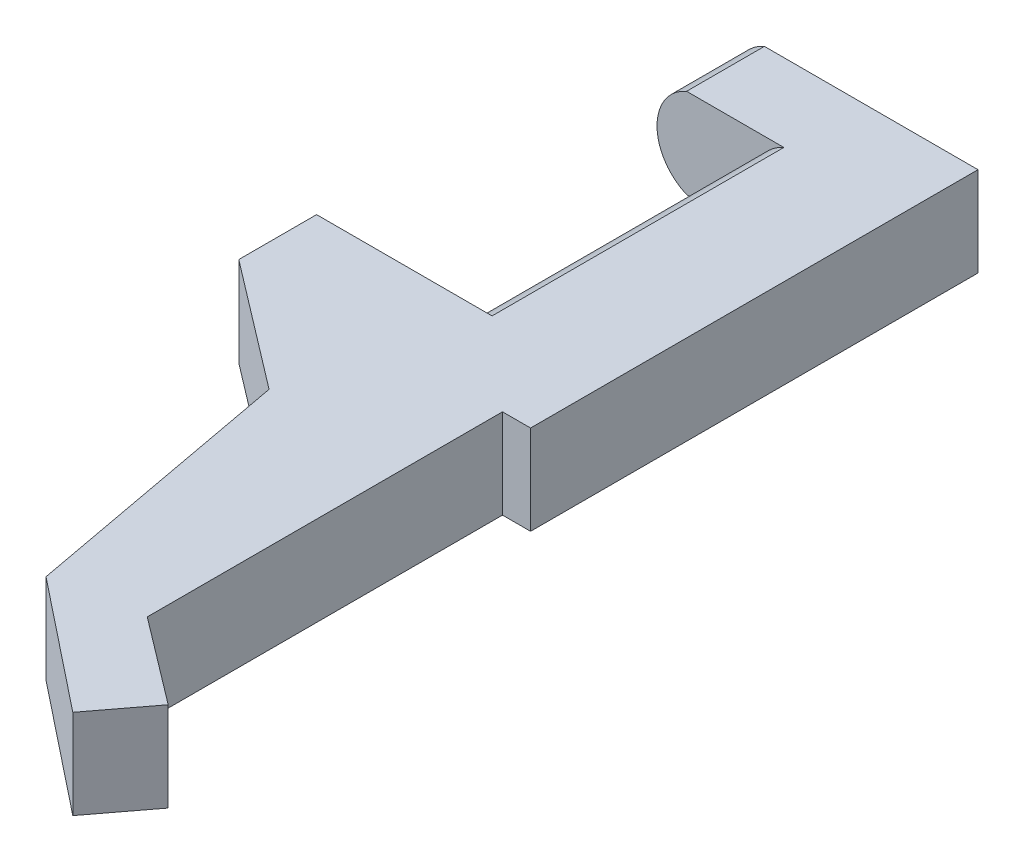
ISO-10303-21;
HEADER;
FILE_DESCRIPTION(('STEP AP214'),'2;1');
FILE_NAME('part.step','',(''),(''),'','','');
FILE_SCHEMA(('AUTOMOTIVE_DESIGN { 1 0 10303 214 1 1 1 1 }'));
ENDSEC;
DATA;
#1=APPLICATION_CONTEXT('core data for automotive mechanical design processes');
#2=APPLICATION_PROTOCOL_DEFINITION('international standard','automotive_design',2000,#1);
#3=PRODUCT_CONTEXT('',#1,'mechanical');
#4=PRODUCT('Part','Part','',(#3));
#5=PRODUCT_RELATED_PRODUCT_CATEGORY('part','',(#4));
#6=PRODUCT_DEFINITION_FORMATION('','',#4);
#7=PRODUCT_DEFINITION_CONTEXT('part definition',#1,'design');
#8=PRODUCT_DEFINITION('design','',#6,#7);
#9=PRODUCT_DEFINITION_SHAPE('','',#8);
#10=(LENGTH_UNIT() NAMED_UNIT(*) SI_UNIT(.MILLI.,.METRE.));
#11=(NAMED_UNIT(*) PLANE_ANGLE_UNIT() SI_UNIT($,.RADIAN.));
#12=(NAMED_UNIT(*) SI_UNIT($,.STERADIAN.) SOLID_ANGLE_UNIT());
#13=UNCERTAINTY_MEASURE_WITH_UNIT(LENGTH_MEASURE(1.E-05),#10,'distance_accuracy_value','');
#14=(GEOMETRIC_REPRESENTATION_CONTEXT(3) GLOBAL_UNCERTAINTY_ASSIGNED_CONTEXT((#13)) GLOBAL_UNIT_ASSIGNED_CONTEXT((#10,
#11,#12)) REPRESENTATION_CONTEXT('',''));
#15=CARTESIAN_POINT('',(0.,0.,0.));
#16=DIRECTION('',(0.,0.,1.));
#17=DIRECTION('',(1.,0.,0.));
#18=AXIS2_PLACEMENT_3D('',#15,#16,#17);
#19=CARTESIAN_POINT('',(0.,0.,4.));
#20=DIRECTION('',(0.,0.,-1.));
#21=DIRECTION('',(-1.,0.,0.));
#22=AXIS2_PLACEMENT_3D('',#19,#20,#21);
#23=PLANE('',#22);
#24=DIRECTION('',(0.,1.,0.));
#25=VECTOR('',#24,1.);
#26=CARTESIAN_POINT('',(539.301234579367,412.744075085687,4.));
#27=LINE('',#26,#25);
#28=CARTESIAN_POINT('',(539.301234579367,407.944075085687,4.));
#29=VERTEX_POINT('',#28);
#30=CARTESIAN_POINT('',(539.301234579367,412.544075085687,4.));
#31=VERTEX_POINT('',#30);
#32=EDGE_CURVE('E206',#29,#31,#27,.T.);
#33=ORIENTED_EDGE('',*,*,#32,.T.);
#34=DIRECTION('',(-1.,0.,0.));
#35=VECTOR('',#34,1.);
#36=CARTESIAN_POINT('',(0.,412.544075085687,4.));
#37=LINE('',#36,#35);
#38=CARTESIAN_POINT('',(537.858436246438,412.544075085687,4.));
#39=VERTEX_POINT('',#38);
#40=EDGE_CURVE('E249',#31,#39,#37,.T.);
#41=ORIENTED_EDGE('',*,*,#40,.T.);
#42=DIRECTION('',(0.,1.,0.));
#43=VECTOR('',#42,1.);
#44=CARTESIAN_POINT('',(537.858436246438,407.744075085687,4.));
#45=LINE('',#44,#43);
#46=CARTESIAN_POINT('',(537.858436246438,407.944075085687,4.));
#47=VERTEX_POINT('',#46);
#48=EDGE_CURVE('E203',#47,#39,#45,.T.);
#49=ORIENTED_EDGE('',*,*,#48,.F.);
#50=DIRECTION('',(1.,0.,0.));
#51=VECTOR('',#50,1.);
#52=CARTESIAN_POINT('',(0.,407.944075085687,4.));
#53=LINE('',#52,#51);
#54=EDGE_CURVE('E222',#47,#29,#53,.T.);
#55=ORIENTED_EDGE('',*,*,#54,.T.);
#56=EDGE_LOOP('',(#33,#41,#49,#55));
#57=FACE_BOUND('',#56,.T.);
#58=ADVANCED_FACE('F39',(#57),#23,.F.);
#59=CARTESIAN_POINT('',(534.301234579367,410.244075085687,-24.0138781886599));
#60=DIRECTION('',(0.,0.,1.));
#61=DIRECTION('',(1.,0.,0.));
#62=AXIS2_PLACEMENT_3D('',#59,#60,#61);
#63=CYLINDRICAL_SURFACE('',#62,2.5);
#64=DIRECTION('',(0.,0.,1.));
#65=VECTOR('',#64,1.);
#66=CARTESIAN_POINT('',(533.321438682254,412.544075085687,-24.0138781886599));
#67=LINE('',#66,#65);
#68=CARTESIAN_POINT('',(533.321438682254,412.544075085687,-15.));
#69=VERTEX_POINT('',#68);
#70=CARTESIAN_POINT('',(533.321438682254,412.544075085687,0.));
#71=VERTEX_POINT('',#70);
#72=EDGE_CURVE('E256',#69,#71,#67,.T.);
#73=ORIENTED_EDGE('',*,*,#72,.F.);
#74=CARTESIAN_POINT('',(534.301234579367,410.244075085687,-15.));
#75=DIRECTION('',(0.,0.,1.));
#76=DIRECTION('',(1.,0.,0.));
#77=AXIS2_PLACEMENT_3D('',#74,#75,#76);
#78=CIRCLE('',#77,2.5);
#79=CARTESIAN_POINT('',(533.321438682254,407.944075085687,-15.));
#80=VERTEX_POINT('',#79);
#81=EDGE_CURVE('E173',#80,#69,#78,.F.);
#82=ORIENTED_EDGE('',*,*,#81,.F.);
#83=DIRECTION('',(0.,0.,1.));
#84=VECTOR('',#83,1.);
#85=CARTESIAN_POINT('',(533.321438682254,407.944075085687,-24.0138781886599));
#86=LINE('',#85,#84);
#87=CARTESIAN_POINT('',(533.321438682254,407.944075085687,0.));
#88=VERTEX_POINT('',#87);
#89=EDGE_CURVE('E234',#88,#80,#86,.F.);
#90=ORIENTED_EDGE('',*,*,#89,.F.);
#91=CARTESIAN_POINT('',(534.301234579367,410.244075085687,0.));
#92=DIRECTION('',(0.,0.,1.));
#93=DIRECTION('',(1.,0.,0.));
#94=AXIS2_PLACEMENT_3D('',#91,#92,#93);
#95=CIRCLE('',#94,2.5);
#96=EDGE_CURVE('E165',#71,#88,#95,.T.);
#97=ORIENTED_EDGE('',*,*,#96,.F.);
#98=EDGE_LOOP('',(#73,#82,#90,#97));
#99=FACE_BOUND('',#98,.T.);
#100=ADVANCED_FACE('F41',(#99),#63,.T.);
#101=CARTESIAN_POINT('',(539.301234579367,412.744075085687,-24.0138781886599));
#102=DIRECTION('',(1.,0.,0.));
#103=DIRECTION('',(0.,0.,-1.));
#104=AXIS2_PLACEMENT_3D('',#101,#102,#103);
#105=PLANE('',#104);
#106=DIRECTION('',(0.,0.,-1.));
#107=VECTOR('',#106,1.);
#108=CARTESIAN_POINT('',(539.301234579367,412.544075085687,-24.0138781886599));
#109=LINE('',#108,#107);
#110=CARTESIAN_POINT('',(539.301234579367,412.544075085687,-19.));
#111=VERTEX_POINT('',#110);
#112=EDGE_CURVE('E254',#31,#111,#109,.T.);
#113=ORIENTED_EDGE('',*,*,#112,.F.);
#114=ORIENTED_EDGE('',*,*,#32,.F.);
#115=DIRECTION('',(0.,0.,1.));
#116=VECTOR('',#115,1.);
#117=CARTESIAN_POINT('',(539.301234579367,407.944075085687,-24.0138781886599));
#118=LINE('',#117,#116);
#119=CARTESIAN_POINT('',(539.301234579367,407.944075085687,-19.));
#120=VERTEX_POINT('',#119);
#121=EDGE_CURVE('E232',#120,#29,#118,.T.);
#122=ORIENTED_EDGE('',*,*,#121,.F.);
#123=DIRECTION('',(0.,-1.,0.));
#124=VECTOR('',#123,1.);
#125=CARTESIAN_POINT('',(539.301234579367,412.744075085687,-19.));
#126=LINE('',#125,#124);
#127=EDGE_CURVE('E157',#111,#120,#126,.T.);
#128=ORIENTED_EDGE('',*,*,#127,.F.);
#129=EDGE_LOOP('',(#113,#114,#122,#128));
#130=FACE_BOUND('',#129,.T.);
#131=ADVANCED_FACE('F286',(#130),#105,.T.);
#132=CARTESIAN_POINT('',(529.301234579367,410.244075085687,-19.));
#133=DIRECTION('',(0.,0.,1.));
#134=DIRECTION('',(1.,0.,0.));
#135=AXIS2_PLACEMENT_3D('',#132,#133,#134);
#136=CYLINDRICAL_SURFACE('',#135,2.5);
#137=CARTESIAN_POINT('',(529.301234579367,410.244075085687,-15.));
#138=DIRECTION('',(0.,0.,-1.));
#139=DIRECTION('',(-1.,0.,0.));
#140=AXIS2_PLACEMENT_3D('',#137,#138,#139);
#141=CIRCLE('',#140,2.5);
#142=CARTESIAN_POINT('',(528.321438682254,407.944075085687,-15.));
#143=VERTEX_POINT('',#142);
#144=CARTESIAN_POINT('',(528.321438682254,412.544075085687,-15.));
#145=VERTEX_POINT('',#144);
#146=EDGE_CURVE('E163',#143,#145,#141,.T.);
#147=ORIENTED_EDGE('',*,*,#146,.T.);
#148=DIRECTION('',(0.,0.,1.));
#149=VECTOR('',#148,1.);
#150=CARTESIAN_POINT('',(528.321438682254,412.544075085687,-19.));
#151=LINE('',#150,#149);
#152=CARTESIAN_POINT('',(528.321438682254,412.544075085687,-19.));
#153=VERTEX_POINT('',#152);
#154=EDGE_CURVE('E162',#145,#153,#151,.F.);
#155=ORIENTED_EDGE('',*,*,#154,.T.);
#156=CARTESIAN_POINT('',(529.301234579367,410.244075085687,-19.));
#157=DIRECTION('',(0.,0.,-1.));
#158=DIRECTION('',(-1.,0.,0.));
#159=AXIS2_PLACEMENT_3D('',#156,#157,#158);
#160=CIRCLE('',#159,2.5);
#161=CARTESIAN_POINT('',(528.321438682254,407.944075085687,-19.));
#162=VERTEX_POINT('',#161);
#163=EDGE_CURVE('E155',#162,#153,#160,.T.);
#164=ORIENTED_EDGE('',*,*,#163,.F.);
#165=DIRECTION('',(0.,0.,1.));
#166=VECTOR('',#165,1.);
#167=CARTESIAN_POINT('',(528.321438682254,407.944075085687,-19.));
#168=LINE('',#167,#166);
#169=EDGE_CURVE('E137',#162,#143,#168,.T.);
#170=ORIENTED_EDGE('',*,*,#169,.T.);
#171=EDGE_LOOP('',(#147,#155,#164,#170));
#172=FACE_BOUND('',#171,.T.);
#173=ADVANCED_FACE('F161',(#172),#136,.T.);
#174=CARTESIAN_POINT('',(529.301234579367,410.244075085687,-19.));
#175=DIRECTION('',(0.,0.,-1.));
#176=DIRECTION('',(-1.,0.,0.));
#177=AXIS2_PLACEMENT_3D('',#174,#175,#176);
#178=PLANE('',#177);
#179=DIRECTION('',(-1.,0.,0.));
#180=VECTOR('',#179,1.);
#181=CARTESIAN_POINT('',(544.548779578417,412.544075085687,-19.));
#182=LINE('',#181,#180);
#183=EDGE_CURVE('E158',#111,#153,#182,.T.);
#184=ORIENTED_EDGE('',*,*,#183,.F.);
#185=ORIENTED_EDGE('',*,*,#127,.T.);
#186=DIRECTION('',(1.,0.,0.));
#187=VECTOR('',#186,1.);
#188=CARTESIAN_POINT('',(544.548779578417,407.944075085687,-19.));
#189=LINE('',#188,#187);
#190=EDGE_CURVE('E140',#162,#120,#189,.T.);
#191=ORIENTED_EDGE('',*,*,#190,.F.);
#192=ORIENTED_EDGE('',*,*,#163,.T.);
#193=EDGE_LOOP('',(#184,#185,#191,#192));
#194=FACE_BOUND('',#193,.T.);
#195=ADVANCED_FACE('F154',(#194),#178,.T.);
#196=CARTESIAN_POINT('',(529.301234579367,410.244075085687,-15.));
#197=DIRECTION('',(0.,0.,-1.));
#198=DIRECTION('',(-1.,0.,0.));
#199=AXIS2_PLACEMENT_3D('',#196,#197,#198);
#200=PLANE('',#199);
#201=ORIENTED_EDGE('',*,*,#81,.T.);
#202=DIRECTION('',(-1.,0.,0.));
#203=VECTOR('',#202,1.);
#204=CARTESIAN_POINT('',(529.301234579367,412.544075085687,-15.));
#205=LINE('',#204,#203);
#206=EDGE_CURVE('E258',#69,#145,#205,.T.);
#207=ORIENTED_EDGE('',*,*,#206,.T.);
#208=ORIENTED_EDGE('',*,*,#146,.F.);
#209=DIRECTION('',(1.,0.,0.));
#210=VECTOR('',#209,1.);
#211=CARTESIAN_POINT('',(529.301234579367,407.944075085687,-15.));
#212=LINE('',#211,#210);
#213=EDGE_CURVE('E143',#143,#80,#212,.T.);
#214=ORIENTED_EDGE('',*,*,#213,.T.);
#215=EDGE_LOOP('',(#201,#207,#208,#214));
#216=FACE_BOUND('',#215,.T.);
#217=ADVANCED_FACE('F261',(#216),#200,.F.);
#218=CARTESIAN_POINT('',(524.301234579367,412.744075085687,4.));
#219=DIRECTION('',(1.,0.,0.));
#220=DIRECTION('',(0.,0.,-1.));
#221=AXIS2_PLACEMENT_3D('',#218,#219,#220);
#222=PLANE('',#221);
#223=DIRECTION('',(0.,-1.,0.));
#224=VECTOR('',#223,1.);
#225=CARTESIAN_POINT('',(524.301234579367,412.744075085687,4.));
#226=LINE('',#225,#224);
#227=CARTESIAN_POINT('',(524.301234579367,412.544075085687,3.99999999999998));
#228=VERTEX_POINT('',#227);
#229=CARTESIAN_POINT('',(524.301234579367,407.944075085687,3.99999999999998));
#230=VERTEX_POINT('',#229);
#231=EDGE_CURVE('E167',#228,#230,#226,.T.);
#232=ORIENTED_EDGE('',*,*,#231,.F.);
#233=DIRECTION('',(0.,0.,-1.));
#234=VECTOR('',#233,1.);
#235=CARTESIAN_POINT('',(524.301234579367,412.544075085687,4.));
#236=LINE('',#235,#234);
#237=CARTESIAN_POINT('',(524.301234579367,412.544075085687,0.));
#238=VERTEX_POINT('',#237);
#239=EDGE_CURVE('E218',#228,#238,#236,.T.);
#240=ORIENTED_EDGE('',*,*,#239,.T.);
#241=DIRECTION('',(0.,-1.,0.));
#242=VECTOR('',#241,1.);
#243=CARTESIAN_POINT('',(524.301234579367,412.744075085687,0.));
#244=LINE('',#243,#242);
#245=CARTESIAN_POINT('',(524.301234579367,407.944075085687,0.));
#246=VERTEX_POINT('',#245);
#247=EDGE_CURVE('E170',#238,#246,#244,.T.);
#248=ORIENTED_EDGE('',*,*,#247,.T.);
#249=DIRECTION('',(0.,0.,1.));
#250=VECTOR('',#249,1.);
#251=CARTESIAN_POINT('',(524.301234579367,407.944075085687,4.));
#252=LINE('',#251,#250);
#253=EDGE_CURVE('E220',#246,#230,#252,.T.);
#254=ORIENTED_EDGE('',*,*,#253,.T.);
#255=EDGE_LOOP('',(#232,#240,#248,#254));
#256=FACE_BOUND('',#255,.T.);
#257=ADVANCED_FACE('F216',(#256),#222,.F.);
#258=CARTESIAN_POINT('',(0.,0.,0.));
#259=DIRECTION('',(0.,0.,-1.));
#260=DIRECTION('',(-1.,0.,0.));
#261=AXIS2_PLACEMENT_3D('',#258,#259,#260);
#262=PLANE('',#261);
#263=DIRECTION('',(-1.,0.,0.));
#264=VECTOR('',#263,1.);
#265=CARTESIAN_POINT('',(0.,412.544075085687,0.));
#266=LINE('',#265,#264);
#267=EDGE_CURVE('E252',#71,#238,#266,.T.);
#268=ORIENTED_EDGE('',*,*,#267,.F.);
#269=ORIENTED_EDGE('',*,*,#96,.T.);
#270=DIRECTION('',(1.,0.,0.));
#271=VECTOR('',#270,1.);
#272=CARTESIAN_POINT('',(0.,407.944075085687,0.));
#273=LINE('',#272,#271);
#274=EDGE_CURVE('E225',#246,#88,#273,.T.);
#275=ORIENTED_EDGE('',*,*,#274,.F.);
#276=ORIENTED_EDGE('',*,*,#247,.F.);
#277=EDGE_LOOP('',(#268,#269,#275,#276));
#278=FACE_BOUND('',#277,.T.);
#279=ADVANCED_FACE('F270',(#278),#262,.T.);
#280=CARTESIAN_POINT('',(524.301234579367,407.744075085687,4.));
#281=DIRECTION('',(0.606352912105225,0.,-0.79519566521801));
#282=DIRECTION('',(-0.79519566521801,0.,-0.606352912105225));
#283=AXIS2_PLACEMENT_3D('',#280,#281,#282);
#284=PLANE('',#283);
#285=DIRECTION('',(0.,1.,0.));
#286=VECTOR('',#285,1.);
#287=CARTESIAN_POINT('',(530.858436246438,407.744075085687,9.));
#288=LINE('',#287,#286);
#289=CARTESIAN_POINT('',(530.858436246438,407.944075085687,9.));
#290=VERTEX_POINT('',#289);
#291=CARTESIAN_POINT('',(530.858436246438,412.544075085687,9.));
#292=VERTEX_POINT('',#291);
#293=EDGE_CURVE('E184',#290,#292,#288,.T.);
#294=ORIENTED_EDGE('',*,*,#293,.T.);
#295=DIRECTION('',(-0.79519566521801,0.,-0.606352912105225));
#296=VECTOR('',#295,1.);
#297=CARTESIAN_POINT('',(524.301234579367,412.544075085687,4.));
#298=LINE('',#297,#296);
#299=EDGE_CURVE('E62',#292,#228,#298,.T.);
#300=ORIENTED_EDGE('',*,*,#299,.T.);
#301=ORIENTED_EDGE('',*,*,#231,.T.);
#302=DIRECTION('',(0.79519566521801,0.,0.606352912105225));
#303=VECTOR('',#302,1.);
#304=CARTESIAN_POINT('',(524.301234579367,407.944075085687,4.));
#305=LINE('',#304,#303);
#306=EDGE_CURVE('E212',#230,#290,#305,.T.);
#307=ORIENTED_EDGE('',*,*,#306,.T.);
#308=EDGE_LOOP('',(#294,#300,#301,#307));
#309=FACE_BOUND('',#308,.T.);
#310=ADVANCED_FACE('F211',(#309),#284,.F.);
#311=CARTESIAN_POINT('',(537.858436246438,407.744075085687,4.));
#312=DIRECTION('',(-1.,0.,0.));
#313=DIRECTION('',(0.,0.,1.));
#314=AXIS2_PLACEMENT_3D('',#311,#312,#313);
#315=PLANE('',#314);
#316=ORIENTED_EDGE('',*,*,#48,.T.);
#317=DIRECTION('',(0.,0.,1.));
#318=VECTOR('',#317,1.);
#319=CARTESIAN_POINT('',(537.858436246438,412.544075085687,4.));
#320=LINE('',#319,#318);
#321=CARTESIAN_POINT('',(537.858436246438,412.544075085687,22.2611885121875));
#322=VERTEX_POINT('',#321);
#323=EDGE_CURVE('E244',#39,#322,#320,.T.);
#324=ORIENTED_EDGE('',*,*,#323,.T.);
#325=DIRECTION('',(0.,1.,0.));
#326=VECTOR('',#325,1.);
#327=CARTESIAN_POINT('',(537.858436246438,407.744075085687,22.2611885121876));
#328=LINE('',#327,#326);
#329=CARTESIAN_POINT('',(537.858436246438,407.944075085687,22.2611885121875));
#330=VERTEX_POINT('',#329);
#331=EDGE_CURVE('E200',#330,#322,#328,.T.);
#332=ORIENTED_EDGE('',*,*,#331,.F.);
#333=DIRECTION('',(0.,0.,-1.));
#334=VECTOR('',#333,1.);
#335=CARTESIAN_POINT('',(537.858436246438,407.944075085687,4.));
#336=LINE('',#335,#334);
#337=EDGE_CURVE('E227',#330,#47,#336,.T.);
#338=ORIENTED_EDGE('',*,*,#337,.T.);
#339=EDGE_LOOP('',(#316,#324,#332,#338));
#340=FACE_BOUND('',#339,.T.);
#341=ADVANCED_FACE('F277',(#340),#315,.F.);
#342=CARTESIAN_POINT('',(537.858436246438,407.744075085687,22.2611885121876));
#343=DIRECTION('',(-0.604089142455036,0.,0.796916750964578));
#344=DIRECTION('',(0.796916750964578,0.,0.604089142455036));
#345=AXIS2_PLACEMENT_3D('',#342,#343,#344);
#346=PLANE('',#345);
#347=ORIENTED_EDGE('',*,*,#331,.T.);
#348=DIRECTION('',(0.796916750964578,0.,0.604089142455036));
#349=VECTOR('',#348,1.);
#350=CARTESIAN_POINT('',(537.858436246438,412.544075085687,22.2611885121876));
#351=LINE('',#350,#349);
#352=CARTESIAN_POINT('',(542.306519396011,412.544075085687,25.6329820303206));
#353=VERTEX_POINT('',#352);
#354=EDGE_CURVE('E241',#322,#353,#351,.T.);
#355=ORIENTED_EDGE('',*,*,#354,.T.);
#356=DIRECTION('',(0.,1.,0.));
#357=VECTOR('',#356,1.);
#358=CARTESIAN_POINT('',(542.306519396011,407.744075085687,25.6329820303206));
#359=LINE('',#358,#357);
#360=CARTESIAN_POINT('',(542.306519396011,407.944075085687,25.6329820303206));
#361=VERTEX_POINT('',#360);
#362=EDGE_CURVE('E193',#361,#353,#359,.T.);
#363=ORIENTED_EDGE('',*,*,#362,.F.);
#364=DIRECTION('',(-0.796916750964578,0.,-0.604089142455036));
#365=VECTOR('',#364,1.);
#366=CARTESIAN_POINT('',(537.858436246438,407.944075085687,22.2611885121876));
#367=LINE('',#366,#365);
#368=EDGE_CURVE('E450',#361,#330,#367,.T.);
#369=ORIENTED_EDGE('',*,*,#368,.T.);
#370=EDGE_LOOP('',(#347,#355,#363,#369));
#371=FACE_BOUND('',#370,.T.);
#372=ADVANCED_FACE('F290',(#371),#346,.F.);
#373=CARTESIAN_POINT('',(542.306519396011,407.744075085687,25.6329820303206));
#374=DIRECTION('',(-0.796916750964585,0.,-0.604089142455027));
#375=DIRECTION('',(-0.604089142455027,0.,0.796916750964585));
#376=AXIS2_PLACEMENT_3D('',#373,#374,#375);
#377=PLANE('',#376);
#378=ORIENTED_EDGE('',*,*,#362,.T.);
#379=DIRECTION('',(-0.604089142455027,0.,0.796916750964585));
#380=VECTOR('',#379,1.);
#381=CARTESIAN_POINT('',(542.306519396011,412.544075085687,25.6329820303206));
#382=LINE('',#381,#380);
#383=CARTESIAN_POINT('',(540.192207397418,412.544075085687,28.4221906586966));
#384=VERTEX_POINT('',#383);
#385=EDGE_CURVE('E238',#353,#384,#382,.T.);
#386=ORIENTED_EDGE('',*,*,#385,.T.);
#387=DIRECTION('',(0.,1.,0.));
#388=VECTOR('',#387,1.);
#389=CARTESIAN_POINT('',(540.192207397418,407.744075085687,28.4221906586966));
#390=LINE('',#389,#388);
#391=CARTESIAN_POINT('',(540.192207397418,407.944075085687,28.4221906586966));
#392=VERTEX_POINT('',#391);
#393=EDGE_CURVE('E191',#392,#384,#390,.T.);
#394=ORIENTED_EDGE('',*,*,#393,.F.);
#395=DIRECTION('',(0.604089142455027,0.,-0.796916750964585));
#396=VECTOR('',#395,1.);
#397=CARTESIAN_POINT('',(542.306519396011,407.944075085687,25.6329820303206));
#398=LINE('',#397,#396);
#399=EDGE_CURVE('E451',#392,#361,#398,.T.);
#400=ORIENTED_EDGE('',*,*,#399,.T.);
#401=EDGE_LOOP('',(#378,#386,#394,#400));
#402=FACE_BOUND('',#401,.T.);
#403=ADVANCED_FACE('F294',(#402),#377,.F.);
#404=CARTESIAN_POINT('',(533.467268804221,407.744075085687,23.0750956348884));
#405=DIRECTION('',(0.622360453375666,0.,-0.782730774962908));
#406=DIRECTION('',(-0.782730774962908,0.,-0.622360453375666));
#407=AXIS2_PLACEMENT_3D('',#404,#405,#406);
#408=PLANE('',#407);
#409=ORIENTED_EDGE('',*,*,#393,.T.);
#410=DIRECTION('',(-0.782730774962908,0.,-0.622360453375666));
#411=VECTOR('',#410,1.);
#412=CARTESIAN_POINT('',(533.467268804221,412.544075085687,23.0750956348884));
#413=LINE('',#412,#411);
#414=CARTESIAN_POINT('',(533.467268804221,412.544075085687,23.0750956348884));
#415=VERTEX_POINT('',#414);
#416=EDGE_CURVE('E148',#384,#415,#413,.T.);
#417=ORIENTED_EDGE('',*,*,#416,.T.);
#418=DIRECTION('',(0.,1.,0.));
#419=VECTOR('',#418,1.);
#420=CARTESIAN_POINT('',(533.467268804221,407.744075085687,23.0750956348884));
#421=LINE('',#420,#419);
#422=CARTESIAN_POINT('',(533.467268804221,407.944075085687,23.0750956348884));
#423=VERTEX_POINT('',#422);
#424=EDGE_CURVE('E182',#423,#415,#421,.T.);
#425=ORIENTED_EDGE('',*,*,#424,.F.);
#426=DIRECTION('',(0.782730774962908,0.,0.622360453375666));
#427=VECTOR('',#426,1.);
#428=CARTESIAN_POINT('',(533.467268804221,407.944075085687,23.0750956348884));
#429=LINE('',#428,#427);
#430=EDGE_CURVE('E54',#423,#392,#429,.T.);
#431=ORIENTED_EDGE('',*,*,#430,.T.);
#432=EDGE_LOOP('',(#409,#417,#425,#431));
#433=FACE_BOUND('',#432,.T.);
#434=ADVANCED_FACE('F189',(#433),#408,.F.);
#435=CARTESIAN_POINT('',(530.858436246438,407.744075085687,9.));
#436=DIRECTION('',(0.983252807391147,0.,-0.182246856646219));
#437=DIRECTION('',(-0.182246856646219,0.,-0.983252807391147));
#438=AXIS2_PLACEMENT_3D('',#435,#436,#437);
#439=PLANE('',#438);
#440=ORIENTED_EDGE('',*,*,#424,.T.);
#441=DIRECTION('',(-0.182246856646219,0.,-0.983252807391147));
#442=VECTOR('',#441,1.);
#443=CARTESIAN_POINT('',(530.858436246438,412.544075085687,9.));
#444=LINE('',#443,#442);
#445=EDGE_CURVE('E11',#415,#292,#444,.T.);
#446=ORIENTED_EDGE('',*,*,#445,.T.);
#447=ORIENTED_EDGE('',*,*,#293,.F.);
#448=DIRECTION('',(0.182246856646219,0.,0.983252807391147));
#449=VECTOR('',#448,1.);
#450=CARTESIAN_POINT('',(530.858436246438,407.944075085687,9.));
#451=LINE('',#450,#449);
#452=EDGE_CURVE('E47',#290,#423,#451,.T.);
#453=ORIENTED_EDGE('',*,*,#452,.T.);
#454=EDGE_LOOP('',(#440,#446,#447,#453));
#455=FACE_BOUND('',#454,.T.);
#456=ADVANCED_FACE('F181',(#455),#439,.F.);
#457=CARTESIAN_POINT('',(544.548779578417,407.944075085687,28.4221906586966));
#458=DIRECTION('',(0.,1.,0.));
#459=DIRECTION('',(0.,0.,1.));
#460=AXIS2_PLACEMENT_3D('',#457,#458,#459);
#461=PLANE('',#460);
#462=ORIENTED_EDGE('',*,*,#190,.T.);
#463=ORIENTED_EDGE('',*,*,#121,.T.);
#464=ORIENTED_EDGE('',*,*,#54,.F.);
#465=ORIENTED_EDGE('',*,*,#337,.F.);
#466=ORIENTED_EDGE('',*,*,#368,.F.);
#467=ORIENTED_EDGE('',*,*,#399,.F.);
#468=ORIENTED_EDGE('',*,*,#430,.F.);
#469=ORIENTED_EDGE('',*,*,#452,.F.);
#470=ORIENTED_EDGE('',*,*,#306,.F.);
#471=ORIENTED_EDGE('',*,*,#253,.F.);
#472=ORIENTED_EDGE('',*,*,#274,.T.);
#473=ORIENTED_EDGE('',*,*,#89,.T.);
#474=ORIENTED_EDGE('',*,*,#213,.F.);
#475=ORIENTED_EDGE('',*,*,#169,.F.);
#476=EDGE_LOOP('',(#462,#463,#464,#465,#466,#467,#468,#469,#470,#471,#472,#473,#474,#475));
#477=FACE_BOUND('',#476,.T.);
#478=ADVANCED_FACE('F139',(#477),#461,.F.);
#479=CARTESIAN_POINT('',(544.548779578417,412.544075085687,28.4221906586966));
#480=DIRECTION('',(0.,-1.,0.));
#481=DIRECTION('',(0.,0.,-1.));
#482=AXIS2_PLACEMENT_3D('',#479,#480,#481);
#483=PLANE('',#482);
#484=ORIENTED_EDGE('',*,*,#206,.F.);
#485=ORIENTED_EDGE('',*,*,#72,.T.);
#486=ORIENTED_EDGE('',*,*,#267,.T.);
#487=ORIENTED_EDGE('',*,*,#239,.F.);
#488=ORIENTED_EDGE('',*,*,#299,.F.);
#489=ORIENTED_EDGE('',*,*,#445,.F.);
#490=ORIENTED_EDGE('',*,*,#416,.F.);
#491=ORIENTED_EDGE('',*,*,#385,.F.);
#492=ORIENTED_EDGE('',*,*,#354,.F.);
#493=ORIENTED_EDGE('',*,*,#323,.F.);
#494=ORIENTED_EDGE('',*,*,#40,.F.);
#495=ORIENTED_EDGE('',*,*,#112,.T.);
#496=ORIENTED_EDGE('',*,*,#183,.T.);
#497=ORIENTED_EDGE('',*,*,#154,.F.);
#498=EDGE_LOOP('',(#484,#485,#486,#487,#488,#489,#490,#491,#492,#493,#494,#495,#496,#497));
#499=FACE_BOUND('',#498,.T.);
#500=ADVANCED_FACE('F264',(#499),#483,.F.);
#501=CLOSED_SHELL('',(#58,#100,#131,#173,#195,#217,#257,#279,#310,#341,#372,#403,#434,#456,#478,#500));
#502=MANIFOLD_SOLID_BREP('B2',#501);
#503=ADVANCED_BREP_SHAPE_REPRESENTATION('',(#18,#502),#14);
#504=SHAPE_DEFINITION_REPRESENTATION(#9,#503);
ENDSEC;
END-ISO-10303-21;
